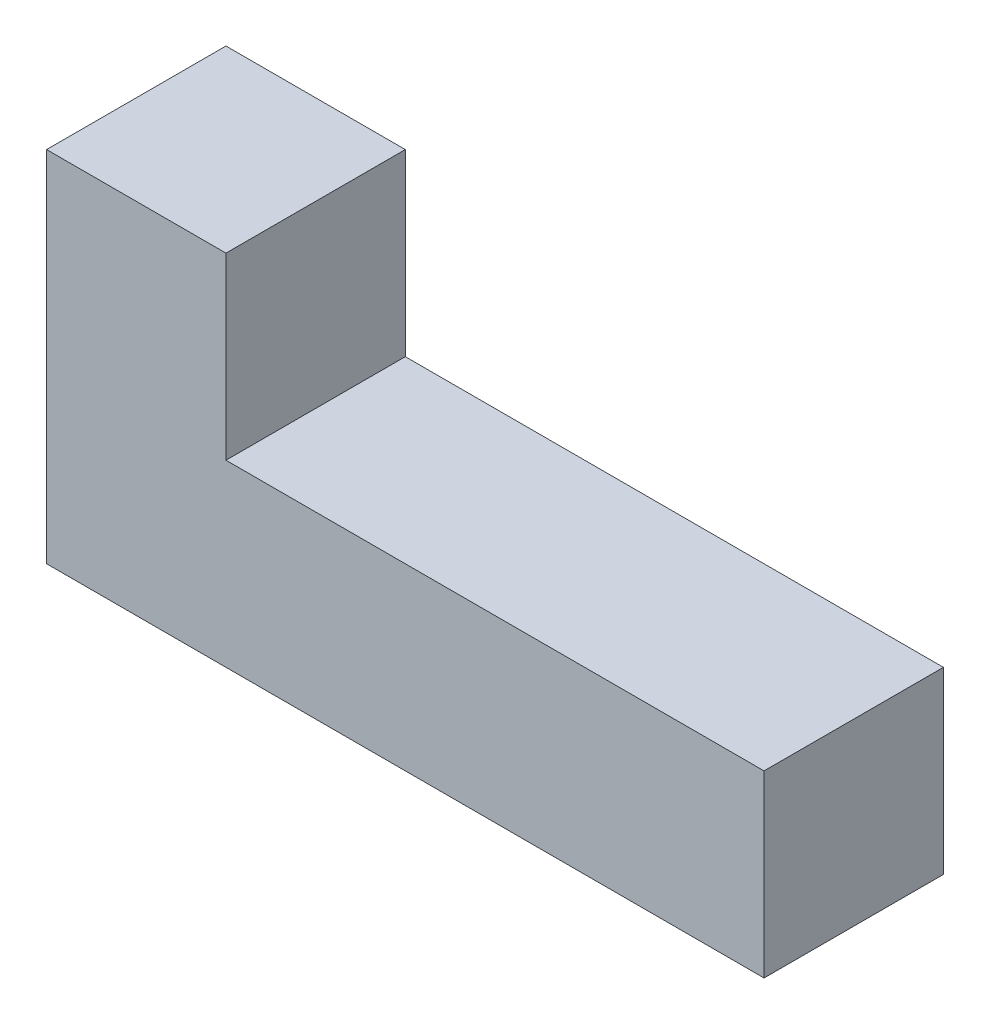
ISO-10303-21;
HEADER;
FILE_DESCRIPTION(('STEP AP214'),'2;1');
FILE_NAME('part.step','',(''),(''),'','','');
FILE_SCHEMA(('AUTOMOTIVE_DESIGN { 1 0 10303 214 1 1 1 1 }'));
ENDSEC;
DATA;
#1=APPLICATION_CONTEXT('core data for automotive mechanical design processes');
#2=APPLICATION_PROTOCOL_DEFINITION('international standard','automotive_design',2000,#1);
#3=PRODUCT_CONTEXT('',#1,'mechanical');
#4=PRODUCT('Part','Part','',(#3));
#5=PRODUCT_RELATED_PRODUCT_CATEGORY('part','',(#4));
#6=PRODUCT_DEFINITION_FORMATION('','',#4);
#7=PRODUCT_DEFINITION_CONTEXT('part definition',#1,'design');
#8=PRODUCT_DEFINITION('design','',#6,#7);
#9=PRODUCT_DEFINITION_SHAPE('','',#8);
#10=(LENGTH_UNIT() NAMED_UNIT(*) SI_UNIT(.MILLI.,.METRE.));
#11=(NAMED_UNIT(*) PLANE_ANGLE_UNIT() SI_UNIT($,.RADIAN.));
#12=(NAMED_UNIT(*) SI_UNIT($,.STERADIAN.) SOLID_ANGLE_UNIT());
#13=UNCERTAINTY_MEASURE_WITH_UNIT(LENGTH_MEASURE(1.E-05),#10,'distance_accuracy_value','');
#14=(GEOMETRIC_REPRESENTATION_CONTEXT(3) GLOBAL_UNCERTAINTY_ASSIGNED_CONTEXT((#13)) GLOBAL_UNIT_ASSIGNED_CONTEXT((#10,
#11,#12)) REPRESENTATION_CONTEXT('',''));
#15=CARTESIAN_POINT('',(0.,0.,0.));
#16=DIRECTION('',(0.,0.,1.));
#17=DIRECTION('',(1.,0.,0.));
#18=AXIS2_PLACEMENT_3D('',#15,#16,#17);
#19=CARTESIAN_POINT('',(0.,0.,25.4));
#20=DIRECTION('',(0.,1.,0.));
#21=DIRECTION('',(0.,0.,1.));
#22=AXIS2_PLACEMENT_3D('',#19,#20,#21);
#23=PLANE('',#22);
#24=DIRECTION('',(1.,0.,0.));
#25=VECTOR('',#24,1.);
#26=CARTESIAN_POINT('',(0.,0.,0.));
#27=LINE('',#26,#25);
#28=CARTESIAN_POINT('',(0.,0.,0.));
#29=VERTEX_POINT('',#28);
#30=CARTESIAN_POINT('',(101.6,0.,0.));
#31=VERTEX_POINT('',#30);
#32=EDGE_CURVE('E117',#29,#31,#27,.T.);
#33=ORIENTED_EDGE('',*,*,#32,.T.);
#34=DIRECTION('',(0.,0.,-1.));
#35=VECTOR('',#34,1.);
#36=CARTESIAN_POINT('',(101.6,0.,25.4));
#37=LINE('',#36,#35);
#38=CARTESIAN_POINT('',(101.6,0.,25.4));
#39=VERTEX_POINT('',#38);
#40=EDGE_CURVE('E11',#39,#31,#37,.T.);
#41=ORIENTED_EDGE('',*,*,#40,.F.);
#42=DIRECTION('',(1.,0.,0.));
#43=VECTOR('',#42,1.);
#44=CARTESIAN_POINT('',(0.,0.,25.4));
#45=LINE('',#44,#43);
#46=CARTESIAN_POINT('',(0.,0.,25.4));
#47=VERTEX_POINT('',#46);
#48=EDGE_CURVE('E127',#47,#39,#45,.T.);
#49=ORIENTED_EDGE('',*,*,#48,.F.);
#50=DIRECTION('',(0.,0.,-1.));
#51=VECTOR('',#50,1.);
#52=CARTESIAN_POINT('',(0.,0.,25.4));
#53=LINE('',#52,#51);
#54=EDGE_CURVE('E113',#47,#29,#53,.T.);
#55=ORIENTED_EDGE('',*,*,#54,.T.);
#56=EDGE_LOOP('',(#33,#41,#49,#55));
#57=FACE_BOUND('',#56,.T.);
#58=ADVANCED_FACE('F33',(#57),#23,.F.);
#59=CARTESIAN_POINT('',(101.6,0.,25.4));
#60=DIRECTION('',(-1.,0.,0.));
#61=DIRECTION('',(0.,0.,1.));
#62=AXIS2_PLACEMENT_3D('',#59,#60,#61);
#63=PLANE('',#62);
#64=DIRECTION('',(0.,1.,0.));
#65=VECTOR('',#64,1.);
#66=CARTESIAN_POINT('',(101.6,0.,0.));
#67=LINE('',#66,#65);
#68=CARTESIAN_POINT('',(101.6,25.4,0.));
#69=VERTEX_POINT('',#68);
#70=EDGE_CURVE('E120',#31,#69,#67,.T.);
#71=ORIENTED_EDGE('',*,*,#70,.T.);
#72=DIRECTION('',(0.,0.,-1.));
#73=VECTOR('',#72,1.);
#74=CARTESIAN_POINT('',(101.6,25.4,25.4));
#75=LINE('',#74,#73);
#76=CARTESIAN_POINT('',(101.6,25.4,25.4));
#77=VERTEX_POINT('',#76);
#78=EDGE_CURVE('E41',#77,#69,#75,.T.);
#79=ORIENTED_EDGE('',*,*,#78,.F.);
#80=DIRECTION('',(0.,1.,0.));
#81=VECTOR('',#80,1.);
#82=CARTESIAN_POINT('',(101.6,0.,25.4));
#83=LINE('',#82,#81);
#84=EDGE_CURVE('E86',#39,#77,#83,.T.);
#85=ORIENTED_EDGE('',*,*,#84,.F.);
#86=ORIENTED_EDGE('',*,*,#40,.T.);
#87=EDGE_LOOP('',(#71,#79,#85,#86));
#88=FACE_BOUND('',#87,.T.);
#89=ADVANCED_FACE('F151',(#88),#63,.F.);
#90=CARTESIAN_POINT('',(101.6,25.4,25.4));
#91=DIRECTION('',(0.,-1.,0.));
#92=DIRECTION('',(0.,0.,-1.));
#93=AXIS2_PLACEMENT_3D('',#90,#91,#92);
#94=PLANE('',#93);
#95=DIRECTION('',(-1.,0.,0.));
#96=VECTOR('',#95,1.);
#97=CARTESIAN_POINT('',(101.6,25.4,0.));
#98=LINE('',#97,#96);
#99=CARTESIAN_POINT('',(25.4,25.4,0.));
#100=VERTEX_POINT('',#99);
#101=EDGE_CURVE('E122',#69,#100,#98,.T.);
#102=ORIENTED_EDGE('',*,*,#101,.T.);
#103=DIRECTION('',(0.,0.,-1.));
#104=VECTOR('',#103,1.);
#105=CARTESIAN_POINT('',(25.4,25.4,25.4));
#106=LINE('',#105,#104);
#107=CARTESIAN_POINT('',(25.4,25.4,25.4));
#108=VERTEX_POINT('',#107);
#109=EDGE_CURVE('E108',#108,#100,#106,.T.);
#110=ORIENTED_EDGE('',*,*,#109,.F.);
#111=DIRECTION('',(-1.,0.,0.));
#112=VECTOR('',#111,1.);
#113=CARTESIAN_POINT('',(101.6,25.4,25.4));
#114=LINE('',#113,#112);
#115=EDGE_CURVE('E99',#77,#108,#114,.T.);
#116=ORIENTED_EDGE('',*,*,#115,.F.);
#117=ORIENTED_EDGE('',*,*,#78,.T.);
#118=EDGE_LOOP('',(#102,#110,#116,#117));
#119=FACE_BOUND('',#118,.T.);
#120=ADVANCED_FACE('F133',(#119),#94,.F.);
#121=CARTESIAN_POINT('',(25.4,25.4,25.4));
#122=DIRECTION('',(-1.,0.,0.));
#123=DIRECTION('',(0.,0.,1.));
#124=AXIS2_PLACEMENT_3D('',#121,#122,#123);
#125=PLANE('',#124);
#126=DIRECTION('',(0.,1.,0.));
#127=VECTOR('',#126,1.);
#128=CARTESIAN_POINT('',(25.4,25.4,0.));
#129=LINE('',#128,#127);
#130=CARTESIAN_POINT('',(25.4,50.8,0.));
#131=VERTEX_POINT('',#130);
#132=EDGE_CURVE('E107',#100,#131,#129,.T.);
#133=ORIENTED_EDGE('',*,*,#132,.T.);
#134=DIRECTION('',(0.,0.,-1.));
#135=VECTOR('',#134,1.);
#136=CARTESIAN_POINT('',(25.4,50.8,25.4));
#137=LINE('',#136,#135);
#138=CARTESIAN_POINT('',(25.4,50.8,25.4));
#139=VERTEX_POINT('',#138);
#140=EDGE_CURVE('E104',#139,#131,#137,.T.);
#141=ORIENTED_EDGE('',*,*,#140,.F.);
#142=DIRECTION('',(0.,1.,0.));
#143=VECTOR('',#142,1.);
#144=CARTESIAN_POINT('',(25.4,25.4,25.4));
#145=LINE('',#144,#143);
#146=EDGE_CURVE('E93',#108,#139,#145,.T.);
#147=ORIENTED_EDGE('',*,*,#146,.F.);
#148=ORIENTED_EDGE('',*,*,#109,.T.);
#149=EDGE_LOOP('',(#133,#141,#147,#148));
#150=FACE_BOUND('',#149,.T.);
#151=ADVANCED_FACE('F105',(#150),#125,.F.);
#152=CARTESIAN_POINT('',(25.4,50.8,25.4));
#153=DIRECTION('',(0.,-1.,0.));
#154=DIRECTION('',(0.,0.,-1.));
#155=AXIS2_PLACEMENT_3D('',#152,#153,#154);
#156=PLANE('',#155);
#157=DIRECTION('',(-1.,0.,0.));
#158=VECTOR('',#157,1.);
#159=CARTESIAN_POINT('',(25.4,50.8,0.));
#160=LINE('',#159,#158);
#161=CARTESIAN_POINT('',(0.,50.8,0.));
#162=VERTEX_POINT('',#161);
#163=EDGE_CURVE('E72',#131,#162,#160,.T.);
#164=ORIENTED_EDGE('',*,*,#163,.T.);
#165=DIRECTION('',(0.,0.,-1.));
#166=VECTOR('',#165,1.);
#167=CARTESIAN_POINT('',(0.,50.8,25.4));
#168=LINE('',#167,#166);
#169=CARTESIAN_POINT('',(0.,50.8,25.4));
#170=VERTEX_POINT('',#169);
#171=EDGE_CURVE('E109',#170,#162,#168,.T.);
#172=ORIENTED_EDGE('',*,*,#171,.F.);
#173=DIRECTION('',(-1.,0.,0.));
#174=VECTOR('',#173,1.);
#175=CARTESIAN_POINT('',(25.4,50.8,25.4));
#176=LINE('',#175,#174);
#177=EDGE_CURVE('E97',#139,#170,#176,.T.);
#178=ORIENTED_EDGE('',*,*,#177,.F.);
#179=ORIENTED_EDGE('',*,*,#140,.T.);
#180=EDGE_LOOP('',(#164,#172,#178,#179));
#181=FACE_BOUND('',#180,.T.);
#182=ADVANCED_FACE('F111',(#181),#156,.F.);
#183=CARTESIAN_POINT('',(0.,50.8,25.4));
#184=DIRECTION('',(1.,0.,0.));
#185=DIRECTION('',(0.,0.,-1.));
#186=AXIS2_PLACEMENT_3D('',#183,#184,#185);
#187=PLANE('',#186);
#188=DIRECTION('',(0.,-1.,0.));
#189=VECTOR('',#188,1.);
#190=CARTESIAN_POINT('',(0.,50.8,0.));
#191=LINE('',#190,#189);
#192=EDGE_CURVE('E78',#162,#29,#191,.T.);
#193=ORIENTED_EDGE('',*,*,#192,.T.);
#194=ORIENTED_EDGE('',*,*,#54,.F.);
#195=DIRECTION('',(0.,-1.,0.));
#196=VECTOR('',#195,1.);
#197=CARTESIAN_POINT('',(0.,50.8,25.4));
#198=LINE('',#197,#196);
#199=EDGE_CURVE('E49',#170,#47,#198,.T.);
#200=ORIENTED_EDGE('',*,*,#199,.F.);
#201=ORIENTED_EDGE('',*,*,#171,.T.);
#202=EDGE_LOOP('',(#193,#194,#200,#201));
#203=FACE_BOUND('',#202,.T.);
#204=ADVANCED_FACE('F140',(#203),#187,.F.);
#205=CARTESIAN_POINT('',(0.,0.,25.4));
#206=DIRECTION('',(0.,0.,1.));
#207=DIRECTION('',(1.,0.,0.));
#208=AXIS2_PLACEMENT_3D('',#205,#206,#207);
#209=PLANE('',#208);
#210=ORIENTED_EDGE('',*,*,#48,.T.);
#211=ORIENTED_EDGE('',*,*,#84,.T.);
#212=ORIENTED_EDGE('',*,*,#115,.T.);
#213=ORIENTED_EDGE('',*,*,#146,.T.);
#214=ORIENTED_EDGE('',*,*,#177,.T.);
#215=ORIENTED_EDGE('',*,*,#199,.T.);
#216=EDGE_LOOP('',(#210,#211,#212,#213,#214,#215));
#217=FACE_BOUND('',#216,.T.);
#218=ADVANCED_FACE('F95',(#217),#209,.T.);
#219=CARTESIAN_POINT('',(0.,0.,0.));
#220=DIRECTION('',(0.,0.,1.));
#221=DIRECTION('',(1.,0.,0.));
#222=AXIS2_PLACEMENT_3D('',#219,#220,#221);
#223=PLANE('',#222);
#224=ORIENTED_EDGE('',*,*,#32,.F.);
#225=ORIENTED_EDGE('',*,*,#192,.F.);
#226=ORIENTED_EDGE('',*,*,#163,.F.);
#227=ORIENTED_EDGE('',*,*,#132,.F.);
#228=ORIENTED_EDGE('',*,*,#101,.F.);
#229=ORIENTED_EDGE('',*,*,#70,.F.);
#230=EDGE_LOOP('',(#224,#225,#226,#227,#228,#229));
#231=FACE_BOUND('',#230,.T.);
#232=ADVANCED_FACE('F136',(#231),#223,.F.);
#233=CLOSED_SHELL('',(#58,#89,#120,#151,#182,#204,#218,#232));
#234=MANIFOLD_SOLID_BREP('B2',#233);
#235=ADVANCED_BREP_SHAPE_REPRESENTATION('',(#18,#234),#14);
#236=SHAPE_DEFINITION_REPRESENTATION(#9,#235);
ENDSEC;
END-ISO-10303-21;
